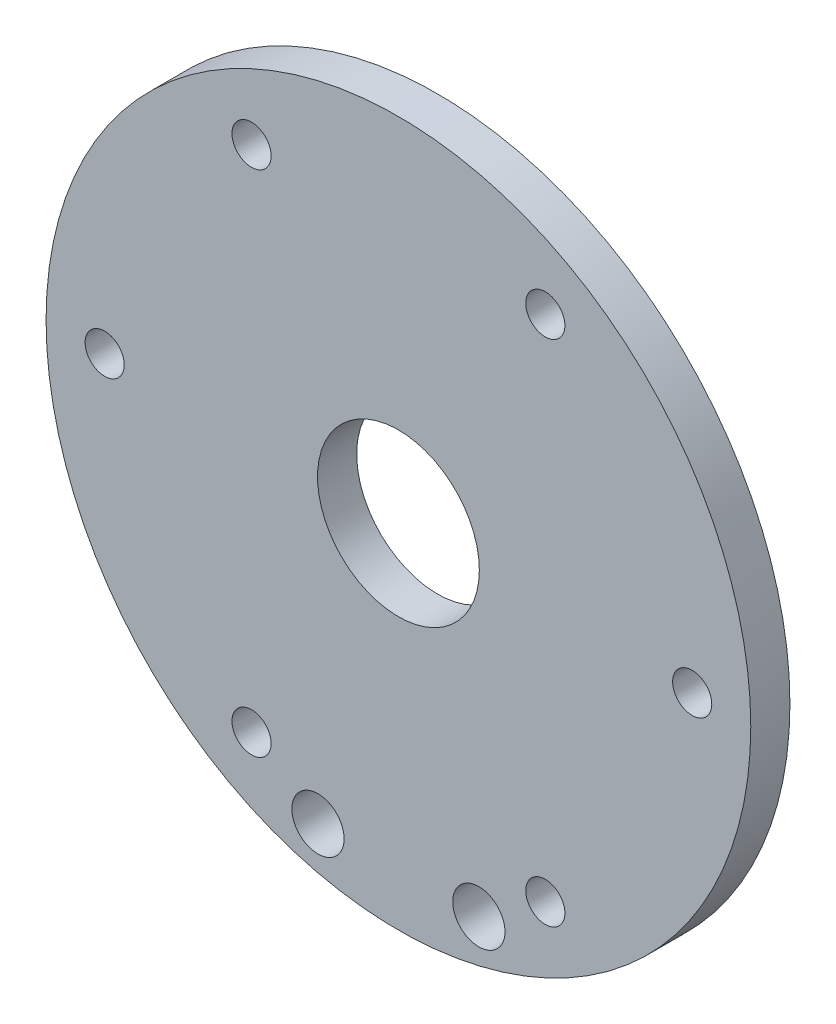
ISO-10303-21;
HEADER;
FILE_DESCRIPTION(('STEP AP214'),'2;1');
FILE_NAME('part.step','',(''),(''),'','','');
FILE_SCHEMA(('AUTOMOTIVE_DESIGN { 1 0 10303 214 1 1 1 1 }'));
ENDSEC;
DATA;
#1=APPLICATION_CONTEXT('core data for automotive mechanical design processes');
#2=APPLICATION_PROTOCOL_DEFINITION('international standard','automotive_design',2000,#1);
#3=PRODUCT_CONTEXT('',#1,'mechanical');
#4=PRODUCT('Part','Part','',(#3));
#5=PRODUCT_RELATED_PRODUCT_CATEGORY('part','',(#4));
#6=PRODUCT_DEFINITION_FORMATION('','',#4);
#7=PRODUCT_DEFINITION_CONTEXT('part definition',#1,'design');
#8=PRODUCT_DEFINITION('design','',#6,#7);
#9=PRODUCT_DEFINITION_SHAPE('','',#8);
#10=(LENGTH_UNIT() NAMED_UNIT(*) SI_UNIT(.MILLI.,.METRE.));
#11=(NAMED_UNIT(*) PLANE_ANGLE_UNIT() SI_UNIT($,.RADIAN.));
#12=(NAMED_UNIT(*) SI_UNIT($,.STERADIAN.) SOLID_ANGLE_UNIT());
#13=UNCERTAINTY_MEASURE_WITH_UNIT(LENGTH_MEASURE(1.E-05),#10,'distance_accuracy_value','');
#14=(GEOMETRIC_REPRESENTATION_CONTEXT(3) GLOBAL_UNCERTAINTY_ASSIGNED_CONTEXT((#13)) GLOBAL_UNIT_ASSIGNED_CONTEXT((#10,
#11,#12)) REPRESENTATION_CONTEXT('',''));
#15=CARTESIAN_POINT('',(0.,0.,0.));
#16=DIRECTION('',(0.,0.,1.));
#17=DIRECTION('',(1.,0.,0.));
#18=AXIS2_PLACEMENT_3D('',#15,#16,#17);
#19=CARTESIAN_POINT('',(3146.41719855616,2145.90334498606,3.));
#20=DIRECTION('',(0.,0.,1.));
#21=DIRECTION('',(1.,0.,0.));
#22=AXIS2_PLACEMENT_3D('',#19,#20,#21);
#23=PLANE('',#22);
#24=CARTESIAN_POINT('',(3157.67237994155,2126.40879897815,3.));
#25=DIRECTION('',(0.,0.,1.));
#26=DIRECTION('',(1.,0.,0.));
#27=AXIS2_PLACEMENT_3D('',#24,#25,#26);
#28=CIRCLE('',#27,1.50000000000006);
#29=CARTESIAN_POINT('',(3159.17237994155,2126.40879897815,3.));
#30=VERTEX_POINT('',#29);
#31=EDGE_CURVE('E90',#30,#30,#28,.T.);
#32=ORIENTED_EDGE('',*,*,#31,.F.);
#33=EDGE_LOOP('',(#32));
#34=FACE_BOUND('',#33,.T.);
#35=CARTESIAN_POINT('',(3123.90683578537,2145.90334498606,3.));
#36=DIRECTION('',(0.,0.,1.));
#37=DIRECTION('',(1.,0.,0.));
#38=AXIS2_PLACEMENT_3D('',#35,#36,#37);
#39=CIRCLE('',#38,1.50000000000006);
#40=CARTESIAN_POINT('',(3125.40683578537,2145.90334498606,3.));
#41=VERTEX_POINT('',#40);
#42=EDGE_CURVE('E78',#41,#41,#39,.T.);
#43=ORIENTED_EDGE('',*,*,#42,.F.);
#44=EDGE_LOOP('',(#43));
#45=FACE_BOUND('',#44,.T.);
#46=CARTESIAN_POINT('',(3157.67237994155,2165.39789099396,3.));
#47=DIRECTION('',(0.,0.,1.));
#48=DIRECTION('',(1.,0.,0.));
#49=AXIS2_PLACEMENT_3D('',#46,#47,#48);
#50=CIRCLE('',#49,1.50000000000006);
#51=CARTESIAN_POINT('',(3159.17237994155,2165.39789099396,3.));
#52=VERTEX_POINT('',#51);
#53=EDGE_CURVE('E66',#52,#52,#50,.T.);
#54=ORIENTED_EDGE('',*,*,#53,.F.);
#55=EDGE_LOOP('',(#54));
#56=FACE_BOUND('',#55,.T.);
#57=CARTESIAN_POINT('',(3152.58100112732,2122.87684930599,3.));
#58=DIRECTION('',(0.,0.,1.));
#59=DIRECTION('',(1.,0.,0.));
#60=AXIS2_PLACEMENT_3D('',#57,#58,#59);
#61=CIRCLE('',#60,1.99999999999978);
#62=CARTESIAN_POINT('',(3154.58100112732,2122.87684930599,3.));
#63=VERTEX_POINT('',#62);
#64=EDGE_CURVE('E54',#63,#63,#61,.T.);
#65=ORIENTED_EDGE('',*,*,#64,.F.);
#66=EDGE_LOOP('',(#65));
#67=FACE_BOUND('',#66,.T.);
#68=CARTESIAN_POINT('',(3146.41719855616,2145.90334498606,3.));
#69=DIRECTION('',(0.,0.,1.));
#70=DIRECTION('',(1.,0.,0.));
#71=AXIS2_PLACEMENT_3D('',#68,#69,#70);
#72=CIRCLE('',#71,27.0000000000001);
#73=CARTESIAN_POINT('',(3173.41719855616,2145.90334498606,3.));
#74=VERTEX_POINT('',#73);
#75=EDGE_CURVE('E10',#74,#74,#72,.T.);
#76=ORIENTED_EDGE('',*,*,#75,.T.);
#77=EDGE_LOOP('',(#76));
#78=FACE_BOUND('',#77,.T.);
#79=CARTESIAN_POINT('',(3146.41719855616,2145.90334498606,3.));
#80=DIRECTION('',(0.,0.,1.));
#81=DIRECTION('',(1.,0.,0.));
#82=AXIS2_PLACEMENT_3D('',#79,#80,#81);
#83=CIRCLE('',#82,6.20000000000021);
#84=CARTESIAN_POINT('',(3152.61719855616,2145.90334498606,3.));
#85=VERTEX_POINT('',#84);
#86=EDGE_CURVE('E49',#85,#85,#83,.T.);
#87=ORIENTED_EDGE('',*,*,#86,.F.);
#88=EDGE_LOOP('',(#87));
#89=FACE_BOUND('',#88,.T.);
#90=CARTESIAN_POINT('',(3168.92756132695,2145.90334498606,3.));
#91=DIRECTION('',(0.,0.,1.));
#92=DIRECTION('',(1.,0.,0.));
#93=AXIS2_PLACEMENT_3D('',#90,#91,#92);
#94=CIRCLE('',#93,1.50000000000006);
#95=CARTESIAN_POINT('',(3170.42756132695,2145.90334498606,3.));
#96=VERTEX_POINT('',#95);
#97=EDGE_CURVE('E60',#96,#96,#94,.T.);
#98=ORIENTED_EDGE('',*,*,#97,.F.);
#99=EDGE_LOOP('',(#98));
#100=FACE_BOUND('',#99,.T.);
#101=CARTESIAN_POINT('',(3135.16201717077,2165.39789099396,3.));
#102=DIRECTION('',(0.,0.,1.));
#103=DIRECTION('',(1.,0.,0.));
#104=AXIS2_PLACEMENT_3D('',#101,#102,#103);
#105=CIRCLE('',#104,1.50000000000006);
#106=CARTESIAN_POINT('',(3136.66201717077,2165.39789099396,3.));
#107=VERTEX_POINT('',#106);
#108=EDGE_CURVE('E72',#107,#107,#105,.T.);
#109=ORIENTED_EDGE('',*,*,#108,.F.);
#110=EDGE_LOOP('',(#109));
#111=FACE_BOUND('',#110,.T.);
#112=CARTESIAN_POINT('',(3135.16201717077,2126.40879897815,3.));
#113=DIRECTION('',(0.,0.,1.));
#114=DIRECTION('',(1.,0.,0.));
#115=AXIS2_PLACEMENT_3D('',#112,#113,#114);
#116=CIRCLE('',#115,1.50000000000006);
#117=CARTESIAN_POINT('',(3136.66201717077,2126.40879897815,3.));
#118=VERTEX_POINT('',#117);
#119=EDGE_CURVE('E84',#118,#118,#116,.T.);
#120=ORIENTED_EDGE('',*,*,#119,.F.);
#121=EDGE_LOOP('',(#120));
#122=FACE_BOUND('',#121,.T.);
#123=CARTESIAN_POINT('',(3140.253395985,2122.87684930599,3.));
#124=DIRECTION('',(0.,0.,1.));
#125=DIRECTION('',(1.,0.,0.));
#126=AXIS2_PLACEMENT_3D('',#123,#124,#125);
#127=CIRCLE('',#126,1.99999999999978);
#128=CARTESIAN_POINT('',(3142.253395985,2122.87684930599,3.));
#129=VERTEX_POINT('',#128);
#130=EDGE_CURVE('E96',#129,#129,#127,.T.);
#131=ORIENTED_EDGE('',*,*,#130,.F.);
#132=EDGE_LOOP('',(#131));
#133=FACE_BOUND('',#132,.T.);
#134=ADVANCED_FACE('F38',(#34,#45,#56,#67,#78,#89,#100,#111,#122,#133),#23,.T.);
#135=CARTESIAN_POINT('',(3146.41719855616,2145.90334498606,0.));
#136=DIRECTION('',(0.,0.,1.));
#137=DIRECTION('',(1.,0.,0.));
#138=AXIS2_PLACEMENT_3D('',#135,#136,#137);
#139=PLANE('',#138);
#140=CARTESIAN_POINT('',(3146.41719855616,2145.90334498606,0.));
#141=DIRECTION('',(0.,0.,1.));
#142=DIRECTION('',(1.,0.,0.));
#143=AXIS2_PLACEMENT_3D('',#140,#141,#142);
#144=CIRCLE('',#143,27.0000000000001);
#145=CARTESIAN_POINT('',(3173.41719855616,2145.90334498606,0.));
#146=VERTEX_POINT('',#145);
#147=EDGE_CURVE('E42',#146,#146,#144,.T.);
#148=ORIENTED_EDGE('',*,*,#147,.F.);
#149=EDGE_LOOP('',(#148));
#150=FACE_BOUND('',#149,.T.);
#151=CARTESIAN_POINT('',(3146.41719855616,2145.90334498606,0.));
#152=DIRECTION('',(0.,0.,1.));
#153=DIRECTION('',(1.,0.,0.));
#154=AXIS2_PLACEMENT_3D('',#151,#152,#153);
#155=CIRCLE('',#154,6.20000000000021);
#156=CARTESIAN_POINT('',(3152.61719855616,2145.90334498606,0.));
#157=VERTEX_POINT('',#156);
#158=EDGE_CURVE('E51',#157,#157,#155,.T.);
#159=ORIENTED_EDGE('',*,*,#158,.T.);
#160=EDGE_LOOP('',(#159));
#161=FACE_BOUND('',#160,.T.);
#162=CARTESIAN_POINT('',(3152.58100112732,2122.87684930599,0.));
#163=DIRECTION('',(0.,0.,1.));
#164=DIRECTION('',(1.,0.,0.));
#165=AXIS2_PLACEMENT_3D('',#162,#163,#164);
#166=CIRCLE('',#165,1.99999999999978);
#167=CARTESIAN_POINT('',(3154.58100112732,2122.87684930599,0.));
#168=VERTEX_POINT('',#167);
#169=EDGE_CURVE('E57',#168,#168,#166,.T.);
#170=ORIENTED_EDGE('',*,*,#169,.T.);
#171=EDGE_LOOP('',(#170));
#172=FACE_BOUND('',#171,.T.);
#173=CARTESIAN_POINT('',(3168.92756132695,2145.90334498606,0.));
#174=DIRECTION('',(0.,0.,1.));
#175=DIRECTION('',(1.,0.,0.));
#176=AXIS2_PLACEMENT_3D('',#173,#174,#175);
#177=CIRCLE('',#176,1.50000000000006);
#178=CARTESIAN_POINT('',(3170.42756132695,2145.90334498606,0.));
#179=VERTEX_POINT('',#178);
#180=EDGE_CURVE('E63',#179,#179,#177,.T.);
#181=ORIENTED_EDGE('',*,*,#180,.T.);
#182=EDGE_LOOP('',(#181));
#183=FACE_BOUND('',#182,.T.);
#184=CARTESIAN_POINT('',(3157.67237994155,2165.39789099396,0.));
#185=DIRECTION('',(0.,0.,1.));
#186=DIRECTION('',(1.,0.,0.));
#187=AXIS2_PLACEMENT_3D('',#184,#185,#186);
#188=CIRCLE('',#187,1.50000000000006);
#189=CARTESIAN_POINT('',(3159.17237994155,2165.39789099396,0.));
#190=VERTEX_POINT('',#189);
#191=EDGE_CURVE('E69',#190,#190,#188,.T.);
#192=ORIENTED_EDGE('',*,*,#191,.T.);
#193=EDGE_LOOP('',(#192));
#194=FACE_BOUND('',#193,.T.);
#195=CARTESIAN_POINT('',(3135.16201717077,2165.39789099396,0.));
#196=DIRECTION('',(0.,0.,1.));
#197=DIRECTION('',(1.,0.,0.));
#198=AXIS2_PLACEMENT_3D('',#195,#196,#197);
#199=CIRCLE('',#198,1.50000000000006);
#200=CARTESIAN_POINT('',(3136.66201717077,2165.39789099396,0.));
#201=VERTEX_POINT('',#200);
#202=EDGE_CURVE('E75',#201,#201,#199,.T.);
#203=ORIENTED_EDGE('',*,*,#202,.T.);
#204=EDGE_LOOP('',(#203));
#205=FACE_BOUND('',#204,.T.);
#206=CARTESIAN_POINT('',(3123.90683578537,2145.90334498606,0.));
#207=DIRECTION('',(0.,0.,1.));
#208=DIRECTION('',(1.,0.,0.));
#209=AXIS2_PLACEMENT_3D('',#206,#207,#208);
#210=CIRCLE('',#209,1.50000000000006);
#211=CARTESIAN_POINT('',(3125.40683578537,2145.90334498606,0.));
#212=VERTEX_POINT('',#211);
#213=EDGE_CURVE('E81',#212,#212,#210,.T.);
#214=ORIENTED_EDGE('',*,*,#213,.T.);
#215=EDGE_LOOP('',(#214));
#216=FACE_BOUND('',#215,.T.);
#217=CARTESIAN_POINT('',(3135.16201717077,2126.40879897815,0.));
#218=DIRECTION('',(0.,0.,1.));
#219=DIRECTION('',(1.,0.,0.));
#220=AXIS2_PLACEMENT_3D('',#217,#218,#219);
#221=CIRCLE('',#220,1.50000000000006);
#222=CARTESIAN_POINT('',(3136.66201717077,2126.40879897815,0.));
#223=VERTEX_POINT('',#222);
#224=EDGE_CURVE('E87',#223,#223,#221,.T.);
#225=ORIENTED_EDGE('',*,*,#224,.T.);
#226=EDGE_LOOP('',(#225));
#227=FACE_BOUND('',#226,.T.);
#228=CARTESIAN_POINT('',(3157.67237994155,2126.40879897815,0.));
#229=DIRECTION('',(0.,0.,1.));
#230=DIRECTION('',(1.,0.,0.));
#231=AXIS2_PLACEMENT_3D('',#228,#229,#230);
#232=CIRCLE('',#231,1.50000000000006);
#233=CARTESIAN_POINT('',(3159.17237994155,2126.40879897815,0.));
#234=VERTEX_POINT('',#233);
#235=EDGE_CURVE('E93',#234,#234,#232,.T.);
#236=ORIENTED_EDGE('',*,*,#235,.T.);
#237=EDGE_LOOP('',(#236));
#238=FACE_BOUND('',#237,.T.);
#239=CARTESIAN_POINT('',(3140.253395985,2122.87684930599,0.));
#240=DIRECTION('',(0.,0.,1.));
#241=DIRECTION('',(1.,0.,0.));
#242=AXIS2_PLACEMENT_3D('',#239,#240,#241);
#243=CIRCLE('',#242,1.99999999999978);
#244=CARTESIAN_POINT('',(3142.253395985,2122.87684930599,0.));
#245=VERTEX_POINT('',#244);
#246=EDGE_CURVE('E99',#245,#245,#243,.T.);
#247=ORIENTED_EDGE('',*,*,#246,.T.);
#248=EDGE_LOOP('',(#247));
#249=FACE_BOUND('',#248,.T.);
#250=ADVANCED_FACE('F109',(#150,#161,#172,#183,#194,#205,#216,#227,#238,#249),#139,.F.);
#251=CARTESIAN_POINT('',(3146.41719855616,2145.90334498606,3.));
#252=DIRECTION('',(0.,0.,-1.));
#253=DIRECTION('',(-1.,0.,0.));
#254=AXIS2_PLACEMENT_3D('',#251,#252,#253);
#255=CYLINDRICAL_SURFACE('',#254,27.0000000000001);
#256=ORIENTED_EDGE('',*,*,#75,.F.);
#257=EDGE_LOOP('',(#256));
#258=FACE_BOUND('',#257,.T.);
#259=ORIENTED_EDGE('',*,*,#147,.T.);
#260=EDGE_LOOP('',(#259));
#261=FACE_BOUND('',#260,.T.);
#262=ADVANCED_FACE('F40',(#258,#261),#255,.T.);
#263=CARTESIAN_POINT('',(3146.41719855616,2145.90334498606,3.));
#264=DIRECTION('',(0.,0.,-1.));
#265=DIRECTION('',(-1.,0.,0.));
#266=AXIS2_PLACEMENT_3D('',#263,#264,#265);
#267=CYLINDRICAL_SURFACE('',#266,6.20000000000021);
#268=ORIENTED_EDGE('',*,*,#86,.T.);
#269=EDGE_LOOP('',(#268));
#270=FACE_BOUND('',#269,.T.);
#271=ORIENTED_EDGE('',*,*,#158,.F.);
#272=EDGE_LOOP('',(#271));
#273=FACE_BOUND('',#272,.T.);
#274=ADVANCED_FACE('F119',(#270,#273),#267,.F.);
#275=CARTESIAN_POINT('',(3152.58100112732,2122.87684930599,3.));
#276=DIRECTION('',(0.,0.,-1.));
#277=DIRECTION('',(-1.,0.,0.));
#278=AXIS2_PLACEMENT_3D('',#275,#276,#277);
#279=CYLINDRICAL_SURFACE('',#278,1.99999999999978);
#280=ORIENTED_EDGE('',*,*,#64,.T.);
#281=EDGE_LOOP('',(#280));
#282=FACE_BOUND('',#281,.T.);
#283=ORIENTED_EDGE('',*,*,#169,.F.);
#284=EDGE_LOOP('',(#283));
#285=FACE_BOUND('',#284,.T.);
#286=ADVANCED_FACE('F122',(#282,#285),#279,.F.);
#287=CARTESIAN_POINT('',(3168.92756132695,2145.90334498606,3.));
#288=DIRECTION('',(0.,0.,-1.));
#289=DIRECTION('',(-1.,0.,0.));
#290=AXIS2_PLACEMENT_3D('',#287,#288,#289);
#291=CYLINDRICAL_SURFACE('',#290,1.50000000000006);
#292=ORIENTED_EDGE('',*,*,#97,.T.);
#293=EDGE_LOOP('',(#292));
#294=FACE_BOUND('',#293,.T.);
#295=ORIENTED_EDGE('',*,*,#180,.F.);
#296=EDGE_LOOP('',(#295));
#297=FACE_BOUND('',#296,.T.);
#298=ADVANCED_FACE('F126',(#294,#297),#291,.F.);
#299=CARTESIAN_POINT('',(3157.67237994155,2165.39789099396,3.));
#300=DIRECTION('',(0.,0.,-1.));
#301=DIRECTION('',(-1.,0.,0.));
#302=AXIS2_PLACEMENT_3D('',#299,#300,#301);
#303=CYLINDRICAL_SURFACE('',#302,1.50000000000006);
#304=ORIENTED_EDGE('',*,*,#53,.T.);
#305=EDGE_LOOP('',(#304));
#306=FACE_BOUND('',#305,.T.);
#307=ORIENTED_EDGE('',*,*,#191,.F.);
#308=EDGE_LOOP('',(#307));
#309=FACE_BOUND('',#308,.T.);
#310=ADVANCED_FACE('F130',(#306,#309),#303,.F.);
#311=CARTESIAN_POINT('',(3135.16201717077,2165.39789099396,3.));
#312=DIRECTION('',(0.,0.,-1.));
#313=DIRECTION('',(-1.,0.,0.));
#314=AXIS2_PLACEMENT_3D('',#311,#312,#313);
#315=CYLINDRICAL_SURFACE('',#314,1.50000000000006);
#316=ORIENTED_EDGE('',*,*,#108,.T.);
#317=EDGE_LOOP('',(#316));
#318=FACE_BOUND('',#317,.T.);
#319=ORIENTED_EDGE('',*,*,#202,.F.);
#320=EDGE_LOOP('',(#319));
#321=FACE_BOUND('',#320,.T.);
#322=ADVANCED_FACE('F134',(#318,#321),#315,.F.);
#323=CARTESIAN_POINT('',(3123.90683578537,2145.90334498606,3.));
#324=DIRECTION('',(0.,0.,-1.));
#325=DIRECTION('',(-1.,0.,0.));
#326=AXIS2_PLACEMENT_3D('',#323,#324,#325);
#327=CYLINDRICAL_SURFACE('',#326,1.50000000000006);
#328=ORIENTED_EDGE('',*,*,#42,.T.);
#329=EDGE_LOOP('',(#328));
#330=FACE_BOUND('',#329,.T.);
#331=ORIENTED_EDGE('',*,*,#213,.F.);
#332=EDGE_LOOP('',(#331));
#333=FACE_BOUND('',#332,.T.);
#334=ADVANCED_FACE('F138',(#330,#333),#327,.F.);
#335=CARTESIAN_POINT('',(3135.16201717077,2126.40879897815,3.));
#336=DIRECTION('',(0.,0.,-1.));
#337=DIRECTION('',(-1.,0.,0.));
#338=AXIS2_PLACEMENT_3D('',#335,#336,#337);
#339=CYLINDRICAL_SURFACE('',#338,1.50000000000006);
#340=ORIENTED_EDGE('',*,*,#119,.T.);
#341=EDGE_LOOP('',(#340));
#342=FACE_BOUND('',#341,.T.);
#343=ORIENTED_EDGE('',*,*,#224,.F.);
#344=EDGE_LOOP('',(#343));
#345=FACE_BOUND('',#344,.T.);
#346=ADVANCED_FACE('F142',(#342,#345),#339,.F.);
#347=CARTESIAN_POINT('',(3157.67237994155,2126.40879897815,3.));
#348=DIRECTION('',(0.,0.,-1.));
#349=DIRECTION('',(-1.,0.,0.));
#350=AXIS2_PLACEMENT_3D('',#347,#348,#349);
#351=CYLINDRICAL_SURFACE('',#350,1.50000000000006);
#352=ORIENTED_EDGE('',*,*,#31,.T.);
#353=EDGE_LOOP('',(#352));
#354=FACE_BOUND('',#353,.T.);
#355=ORIENTED_EDGE('',*,*,#235,.F.);
#356=EDGE_LOOP('',(#355));
#357=FACE_BOUND('',#356,.T.);
#358=ADVANCED_FACE('F146',(#354,#357),#351,.F.);
#359=CARTESIAN_POINT('',(3140.253395985,2122.87684930599,3.));
#360=DIRECTION('',(0.,0.,-1.));
#361=DIRECTION('',(-1.,0.,0.));
#362=AXIS2_PLACEMENT_3D('',#359,#360,#361);
#363=CYLINDRICAL_SURFACE('',#362,1.99999999999978);
#364=ORIENTED_EDGE('',*,*,#130,.T.);
#365=EDGE_LOOP('',(#364));
#366=FACE_BOUND('',#365,.T.);
#367=ORIENTED_EDGE('',*,*,#246,.F.);
#368=EDGE_LOOP('',(#367));
#369=FACE_BOUND('',#368,.T.);
#370=ADVANCED_FACE('F105',(#366,#369),#363,.F.);
#371=CLOSED_SHELL('',(#134,#250,#262,#274,#286,#298,#310,#322,#334,#346,#358,#370));
#372=MANIFOLD_SOLID_BREP('B2',#371);
#373=ADVANCED_BREP_SHAPE_REPRESENTATION('',(#18,#372),#14);
#374=SHAPE_DEFINITION_REPRESENTATION(#9,#373);
ENDSEC;
END-ISO-10303-21;
